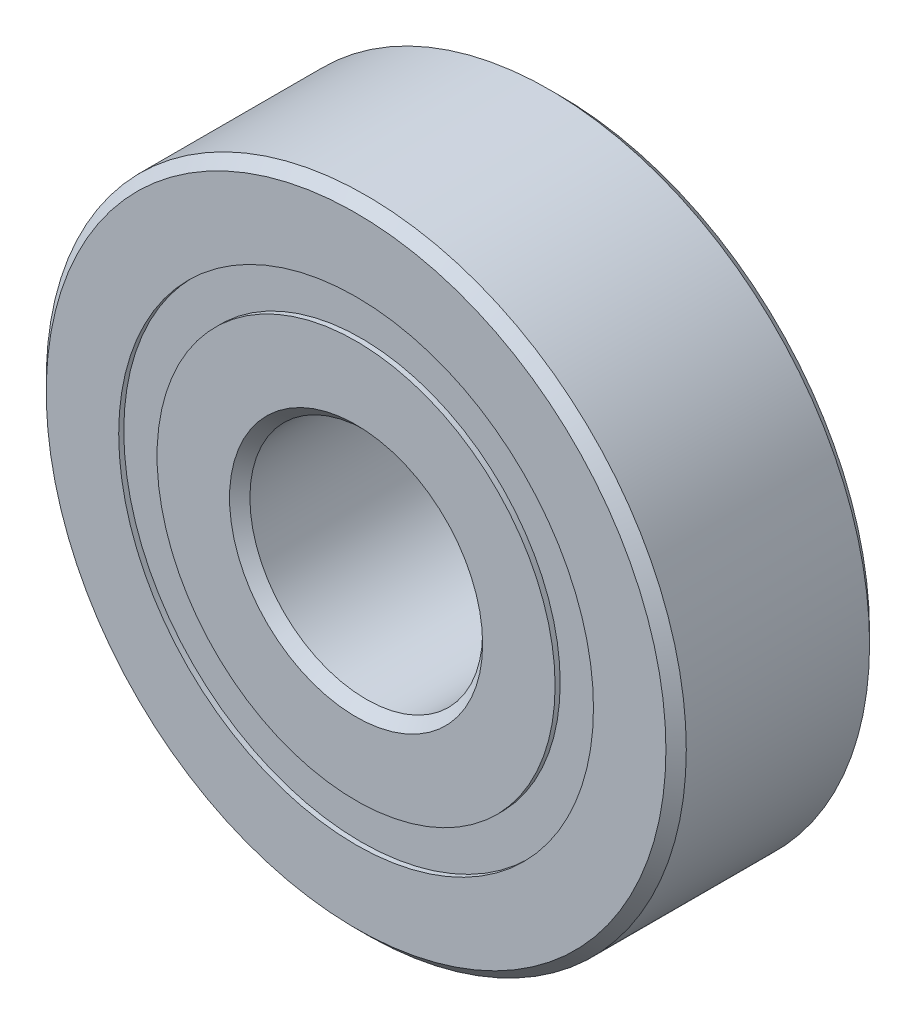
ISO-10303-21;
HEADER;
FILE_DESCRIPTION(('STEP AP214'),'2;1');
FILE_NAME('part.step','',(''),(''),'','','');
FILE_SCHEMA(('AUTOMOTIVE_DESIGN { 1 0 10303 214 1 1 1 1 }'));
ENDSEC;
DATA;
#1=APPLICATION_CONTEXT('core data for automotive mechanical design processes');
#2=APPLICATION_PROTOCOL_DEFINITION('international standard','automotive_design',2000,#1);
#3=PRODUCT_CONTEXT('',#1,'mechanical');
#4=PRODUCT('Part','Part','',(#3));
#5=PRODUCT_RELATED_PRODUCT_CATEGORY('part','',(#4));
#6=PRODUCT_DEFINITION_FORMATION('','',#4);
#7=PRODUCT_DEFINITION_CONTEXT('part definition',#1,'design');
#8=PRODUCT_DEFINITION('design','',#6,#7);
#9=PRODUCT_DEFINITION_SHAPE('','',#8);
#10=(LENGTH_UNIT() NAMED_UNIT(*) SI_UNIT(.MILLI.,.METRE.));
#11=(NAMED_UNIT(*) PLANE_ANGLE_UNIT() SI_UNIT($,.RADIAN.));
#12=(NAMED_UNIT(*) SI_UNIT($,.STERADIAN.) SOLID_ANGLE_UNIT());
#13=UNCERTAINTY_MEASURE_WITH_UNIT(LENGTH_MEASURE(1.E-05),#10,'distance_accuracy_value','');
#14=(GEOMETRIC_REPRESENTATION_CONTEXT(3) GLOBAL_UNCERTAINTY_ASSIGNED_CONTEXT((#13)) GLOBAL_UNIT_ASSIGNED_CONTEXT((#10,
#11,#12)) REPRESENTATION_CONTEXT('',''));
#15=CARTESIAN_POINT('',(0.,0.,0.));
#16=DIRECTION('',(0.,0.,1.));
#17=DIRECTION('',(1.,0.,0.));
#18=AXIS2_PLACEMENT_3D('',#15,#16,#17);
#19=CARTESIAN_POINT('',(0.,8.15934065934066,-3.325));
#20=DIRECTION('',(0.,0.,1.));
#21=DIRECTION('',(1.,0.,0.));
#22=AXIS2_PLACEMENT_3D('',#19,#20,#21);
#23=PLANE('',#22);
#24=CARTESIAN_POINT('',(0.,0.,-3.325));
#25=DIRECTION('',(0.,0.,1.));
#26=DIRECTION('',(1.,0.,0.));
#27=AXIS2_PLACEMENT_3D('',#24,#25,#26);
#28=CIRCLE('',#27,8.15934065934066);
#29=CARTESIAN_POINT('',(8.15934065934066,0.,-3.325));
#30=VERTEX_POINT('',#29);
#31=EDGE_CURVE('E64',#30,#30,#28,.T.);
#32=ORIENTED_EDGE('',*,*,#31,.F.);
#33=EDGE_LOOP('',(#32));
#34=FACE_BOUND('',#33,.T.);
#35=CARTESIAN_POINT('',(0.,0.,-3.325));
#36=DIRECTION('',(0.,0.,1.));
#37=DIRECTION('',(1.,0.,0.));
#38=AXIS2_PLACEMENT_3D('',#35,#36,#37);
#39=CIRCLE('',#38,6.84065934065934);
#40=CARTESIAN_POINT('',(6.84065934065934,0.,-3.325));
#41=VERTEX_POINT('',#40);
#42=EDGE_CURVE('E11',#41,#41,#39,.T.);
#43=ORIENTED_EDGE('',*,*,#42,.T.);
#44=EDGE_LOOP('',(#43));
#45=FACE_BOUND('',#44,.T.);
#46=ADVANCED_FACE('F50',(#34,#45),#23,.F.);
#47=CARTESIAN_POINT('',(0.,0.,3.5));
#48=DIRECTION('',(0.,0.,1.));
#49=DIRECTION('',(1.,0.,0.));
#50=AXIS2_PLACEMENT_3D('',#47,#48,#49);
#51=CYLINDRICAL_SURFACE('',#50,6.84065934065934);
#52=ORIENTED_EDGE('',*,*,#42,.F.);
#53=EDGE_LOOP('',(#52));
#54=FACE_BOUND('',#53,.T.);
#55=CARTESIAN_POINT('',(0.,0.,-1.68952158656808));
#56=DIRECTION('',(0.,0.,1.));
#57=DIRECTION('',(1.,0.,0.));
#58=AXIS2_PLACEMENT_3D('',#55,#56,#57);
#59=CIRCLE('',#58,6.84065934065934);
#60=CARTESIAN_POINT('',(6.84065934065934,0.,-1.68952158656808));
#61=VERTEX_POINT('',#60);
#62=EDGE_CURVE('E56',#61,#61,#59,.T.);
#63=ORIENTED_EDGE('',*,*,#62,.T.);
#64=EDGE_LOOP('',(#63));
#65=FACE_BOUND('',#64,.T.);
#66=ADVANCED_FACE('F73',(#54,#65),#51,.F.);
#67=CARTESIAN_POINT('',(0.,8.15934065934066,-1.68952158656808));
#68=DIRECTION('',(0.,0.,-1.));
#69=DIRECTION('',(-1.,0.,0.));
#70=AXIS2_PLACEMENT_3D('',#67,#68,#69);
#71=PLANE('',#70);
#72=ORIENTED_EDGE('',*,*,#62,.F.);
#73=EDGE_LOOP('',(#72));
#74=FACE_BOUND('',#73,.T.);
#75=CARTESIAN_POINT('',(0.,0.,-1.68952158656808));
#76=DIRECTION('',(0.,0.,1.));
#77=DIRECTION('',(1.,0.,0.));
#78=AXIS2_PLACEMENT_3D('',#75,#76,#77);
#79=CIRCLE('',#78,8.15934065934066);
#80=CARTESIAN_POINT('',(8.15934065934066,0.,-1.68952158656808));
#81=VERTEX_POINT('',#80);
#82=EDGE_CURVE('E60',#81,#81,#79,.T.);
#83=ORIENTED_EDGE('',*,*,#82,.T.);
#84=EDGE_LOOP('',(#83));
#85=FACE_BOUND('',#84,.T.);
#86=ADVANCED_FACE('F77',(#74,#85),#71,.F.);
#87=CARTESIAN_POINT('',(0.,0.,3.5));
#88=DIRECTION('',(0.,0.,1.));
#89=DIRECTION('',(1.,0.,0.));
#90=AXIS2_PLACEMENT_3D('',#87,#88,#89);
#91=CYLINDRICAL_SURFACE('',#90,8.15934065934066);
#92=ORIENTED_EDGE('',*,*,#82,.F.);
#93=EDGE_LOOP('',(#92));
#94=FACE_BOUND('',#93,.T.);
#95=ORIENTED_EDGE('',*,*,#31,.T.);
#96=EDGE_LOOP('',(#95));
#97=FACE_BOUND('',#96,.T.);
#98=ADVANCED_FACE('F70',(#94,#97),#91,.T.);
#99=CLOSED_SHELL('',(#46,#66,#86,#98));
#100=MANIFOLD_SOLID_BREP('B2',#99);
#101=CARTESIAN_POINT('',(0.,8.15934065934066,3.325));
#102=DIRECTION('',(0.,0.,-1.));
#103=DIRECTION('',(-1.,0.,0.));
#104=AXIS2_PLACEMENT_3D('',#101,#102,#103);
#105=PLANE('',#104);
#106=CARTESIAN_POINT('',(0.,0.,3.325));
#107=DIRECTION('',(0.,0.,1.));
#108=DIRECTION('',(1.,0.,0.));
#109=AXIS2_PLACEMENT_3D('',#106,#107,#108);
#110=CIRCLE('',#109,6.84065934065934);
#111=CARTESIAN_POINT('',(6.84065934065934,0.,3.325));
#112=VERTEX_POINT('',#111);
#113=EDGE_CURVE('E49',#112,#112,#110,.T.);
#114=ORIENTED_EDGE('',*,*,#113,.F.);
#115=EDGE_LOOP('',(#114));
#116=FACE_BOUND('',#115,.T.);
#117=CARTESIAN_POINT('',(0.,0.,3.325));
#118=DIRECTION('',(0.,0.,1.));
#119=DIRECTION('',(1.,0.,0.));
#120=AXIS2_PLACEMENT_3D('',#117,#118,#119);
#121=CIRCLE('',#120,8.15934065934066);
#122=CARTESIAN_POINT('',(8.15934065934066,0.,3.325));
#123=VERTEX_POINT('',#122);
#124=EDGE_CURVE('E136',#123,#123,#121,.T.);
#125=ORIENTED_EDGE('',*,*,#124,.T.);
#126=EDGE_LOOP('',(#125));
#127=FACE_BOUND('',#126,.T.);
#128=ADVANCED_FACE('F118',(#116,#127),#105,.F.);
#129=CARTESIAN_POINT('',(0.,0.,3.5));
#130=DIRECTION('',(0.,0.,1.));
#131=DIRECTION('',(1.,0.,0.));
#132=AXIS2_PLACEMENT_3D('',#129,#130,#131);
#133=CYLINDRICAL_SURFACE('',#132,6.84065934065934);
#134=CARTESIAN_POINT('',(0.,0.,1.68952158656808));
#135=DIRECTION('',(0.,0.,1.));
#136=DIRECTION('',(1.,0.,0.));
#137=AXIS2_PLACEMENT_3D('',#134,#135,#136);
#138=CIRCLE('',#137,6.84065934065934);
#139=CARTESIAN_POINT('',(6.84065934065934,0.,1.68952158656808));
#140=VERTEX_POINT('',#139);
#141=EDGE_CURVE('E125',#140,#140,#138,.T.);
#142=ORIENTED_EDGE('',*,*,#141,.F.);
#143=EDGE_LOOP('',(#142));
#144=FACE_BOUND('',#143,.T.);
#145=ORIENTED_EDGE('',*,*,#113,.T.);
#146=EDGE_LOOP('',(#145));
#147=FACE_BOUND('',#146,.T.);
#148=ADVANCED_FACE('F151',(#144,#147),#133,.F.);
#149=CARTESIAN_POINT('',(0.,8.15934065934066,1.68952158656808));
#150=DIRECTION('',(0.,0.,1.));
#151=DIRECTION('',(1.,0.,0.));
#152=AXIS2_PLACEMENT_3D('',#149,#150,#151);
#153=PLANE('',#152);
#154=CARTESIAN_POINT('',(0.,0.,1.68952158656808));
#155=DIRECTION('',(0.,0.,1.));
#156=DIRECTION('',(1.,0.,0.));
#157=AXIS2_PLACEMENT_3D('',#154,#155,#156);
#158=CIRCLE('',#157,8.15934065934066);
#159=CARTESIAN_POINT('',(8.15934065934066,0.,1.68952158656808));
#160=VERTEX_POINT('',#159);
#161=EDGE_CURVE('E131',#160,#160,#158,.T.);
#162=ORIENTED_EDGE('',*,*,#161,.F.);
#163=EDGE_LOOP('',(#162));
#164=FACE_BOUND('',#163,.T.);
#165=ORIENTED_EDGE('',*,*,#141,.T.);
#166=EDGE_LOOP('',(#165));
#167=FACE_BOUND('',#166,.T.);
#168=ADVANCED_FACE('F146',(#164,#167),#153,.F.);
#169=CARTESIAN_POINT('',(0.,0.,3.5));
#170=DIRECTION('',(0.,0.,1.));
#171=DIRECTION('',(1.,0.,0.));
#172=AXIS2_PLACEMENT_3D('',#169,#170,#171);
#173=CYLINDRICAL_SURFACE('',#172,8.15934065934066);
#174=ORIENTED_EDGE('',*,*,#124,.F.);
#175=EDGE_LOOP('',(#174));
#176=FACE_BOUND('',#175,.T.);
#177=ORIENTED_EDGE('',*,*,#161,.T.);
#178=EDGE_LOOP('',(#177));
#179=FACE_BOUND('',#178,.T.);
#180=ADVANCED_FACE('F143',(#176,#179),#173,.T.);
#181=CLOSED_SHELL('',(#128,#148,#168,#180));
#182=MANIFOLD_SOLID_BREP('B6',#181);
#183=CARTESIAN_POINT('',(-3.74999999999992,6.49519052838334,0.));
#184=DIRECTION('',(0.,0.,1.));
#185=DIRECTION('',(-0.499999999999989,0.866025403784445,0.));
#186=AXIS2_PLACEMENT_3D('',#183,#184,#185);
#187=SPHERICAL_SURFACE('',#186,1.68952158656808);
#188=CARTESIAN_POINT('',(-3.74999999999992,6.49519052838334,1.68952158656808));
#189=VERTEX_POINT('',#188);
#190=VERTEX_LOOP('',#189);
#191=FACE_BOUND('',#190,.T.);
#192=ADVANCED_FACE('F190',(#191),#187,.T.);
#193=CLOSED_SHELL('',(#192));
#194=MANIFOLD_SOLID_BREP('B44',#193);
#195=CARTESIAN_POINT('',(-6.49519052838325,3.75000000000008,0.));
#196=DIRECTION('',(0.,0.,1.));
#197=DIRECTION('',(-0.866025403784433,0.50000000000001,0.));
#198=AXIS2_PLACEMENT_3D('',#195,#196,#197);
#199=SPHERICAL_SURFACE('',#198,1.68952158656808);
#200=CARTESIAN_POINT('',(-6.49519052838325,3.75000000000008,1.68952158656808));
#201=VERTEX_POINT('',#200);
#202=VERTEX_LOOP('',#201);
#203=FACE_BOUND('',#202,.T.);
#204=ADVANCED_FACE('F211',(#203),#199,.T.);
#205=CLOSED_SHELL('',(#204));
#206=MANIFOLD_SOLID_BREP('B114',#205);
#207=CARTESIAN_POINT('',(-7.5,0.,0.));
#208=DIRECTION('',(0.,0.,1.));
#209=DIRECTION('',(-1.,0.,0.));
#210=AXIS2_PLACEMENT_3D('',#207,#208,#209);
#211=SPHERICAL_SURFACE('',#210,1.68952158656808);
#212=CARTESIAN_POINT('',(-7.5,0.,1.68952158656808));
#213=VERTEX_POINT('',#212);
#214=VERTEX_LOOP('',#213);
#215=FACE_BOUND('',#214,.T.);
#216=ADVANCED_FACE('F232',(#215),#211,.T.);
#217=CLOSED_SHELL('',(#216));
#218=MANIFOLD_SOLID_BREP('B186',#217);
#219=CARTESIAN_POINT('',(-6.49519052838332,-3.74999999999994,0.));
#220=DIRECTION('',(0.,0.,1.));
#221=DIRECTION('',(-0.866025403784443,-0.499999999999992,0.));
#222=AXIS2_PLACEMENT_3D('',#219,#220,#221);
#223=SPHERICAL_SURFACE('',#222,1.68952158656808);
#224=CARTESIAN_POINT('',(-6.49519052838332,-3.74999999999994,1.68952158656808));
#225=VERTEX_POINT('',#224);
#226=VERTEX_LOOP('',#225);
#227=FACE_BOUND('',#226,.T.);
#228=ADVANCED_FACE('F253',(#227),#223,.T.);
#229=CLOSED_SHELL('',(#228));
#230=MANIFOLD_SOLID_BREP('B207',#229);
#231=CARTESIAN_POINT('',(-3.75000000000005,-6.49519052838326,0.));
#232=DIRECTION('',(0.,0.,1.));
#233=DIRECTION('',(-0.500000000000007,-0.866025403784435,0.));
#234=AXIS2_PLACEMENT_3D('',#231,#232,#233);
#235=SPHERICAL_SURFACE('',#234,1.68952158656808);
#236=CARTESIAN_POINT('',(-3.75000000000005,-6.49519052838326,1.68952158656808));
#237=VERTEX_POINT('',#236);
#238=VERTEX_LOOP('',#237);
#239=FACE_BOUND('',#238,.T.);
#240=ADVANCED_FACE('F274',(#239),#235,.T.);
#241=CLOSED_SHELL('',(#240));
#242=MANIFOLD_SOLID_BREP('B228',#241);
#243=CARTESIAN_POINT('',(0.,-7.5,0.));
#244=DIRECTION('',(0.,0.,1.));
#245=DIRECTION('',(0.,-1.,0.));
#246=AXIS2_PLACEMENT_3D('',#243,#244,#245);
#247=SPHERICAL_SURFACE('',#246,1.68952158656808);
#248=CARTESIAN_POINT('',(0.,-7.5,1.68952158656808));
#249=VERTEX_POINT('',#248);
#250=VERTEX_LOOP('',#249);
#251=FACE_BOUND('',#250,.T.);
#252=ADVANCED_FACE('F295',(#251),#247,.T.);
#253=CLOSED_SHELL('',(#252));
#254=MANIFOLD_SOLID_BREP('B249',#253);
#255=CARTESIAN_POINT('',(3.74999999999996,-6.49519052838331,0.));
#256=DIRECTION('',(0.,0.,1.));
#257=DIRECTION('',(0.499999999999995,-0.866025403784442,0.));
#258=AXIS2_PLACEMENT_3D('',#255,#256,#257);
#259=SPHERICAL_SURFACE('',#258,1.68952158656808);
#260=CARTESIAN_POINT('',(3.74999999999996,-6.49519052838331,1.68952158656808));
#261=VERTEX_POINT('',#260);
#262=VERTEX_LOOP('',#261);
#263=FACE_BOUND('',#262,.T.);
#264=ADVANCED_FACE('F316',(#263),#259,.T.);
#265=CLOSED_SHELL('',(#264));
#266=MANIFOLD_SOLID_BREP('B270',#265);
#267=CARTESIAN_POINT('',(6.49519052838327,-3.75000000000003,0.));
#268=DIRECTION('',(0.,0.,1.));
#269=DIRECTION('',(0.866025403784436,-0.500000000000004,0.));
#270=AXIS2_PLACEMENT_3D('',#267,#268,#269);
#271=SPHERICAL_SURFACE('',#270,1.68952158656808);
#272=CARTESIAN_POINT('',(6.49519052838327,-3.75000000000003,1.68952158656808));
#273=VERTEX_POINT('',#272);
#274=VERTEX_LOOP('',#273);
#275=FACE_BOUND('',#274,.T.);
#276=ADVANCED_FACE('F337',(#275),#271,.T.);
#277=CLOSED_SHELL('',(#276));
#278=MANIFOLD_SOLID_BREP('B291',#277);
#279=CARTESIAN_POINT('',(7.5,0.,0.));
#280=DIRECTION('',(0.,0.,1.));
#281=DIRECTION('',(1.,0.,0.));
#282=AXIS2_PLACEMENT_3D('',#279,#280,#281);
#283=SPHERICAL_SURFACE('',#282,1.68952158656808);
#284=CARTESIAN_POINT('',(7.5,0.,1.68952158656808));
#285=VERTEX_POINT('',#284);
#286=VERTEX_LOOP('',#285);
#287=FACE_BOUND('',#286,.T.);
#288=ADVANCED_FACE('F358',(#287),#283,.T.);
#289=CLOSED_SHELL('',(#288));
#290=MANIFOLD_SOLID_BREP('B312',#289);
#291=CARTESIAN_POINT('',(6.4951905283833,3.74999999999998,0.));
#292=DIRECTION('',(0.,0.,1.));
#293=DIRECTION('',(0.86602540378444,0.499999999999998,0.));
#294=AXIS2_PLACEMENT_3D('',#291,#292,#293);
#295=SPHERICAL_SURFACE('',#294,1.68952158656808);
#296=CARTESIAN_POINT('',(6.4951905283833,3.74999999999998,1.68952158656808));
#297=VERTEX_POINT('',#296);
#298=VERTEX_LOOP('',#297);
#299=FACE_BOUND('',#298,.T.);
#300=ADVANCED_FACE('F379',(#299),#295,.T.);
#301=CLOSED_SHELL('',(#300));
#302=MANIFOLD_SOLID_BREP('B333',#301);
#303=CARTESIAN_POINT('',(3.75000000000001,6.49519052838328,0.));
#304=DIRECTION('',(0.,0.,1.));
#305=DIRECTION('',(0.500000000000001,0.866025403784438,0.));
#306=AXIS2_PLACEMENT_3D('',#303,#304,#305);
#307=SPHERICAL_SURFACE('',#306,1.68952158656808);
#308=CARTESIAN_POINT('',(3.75000000000001,6.49519052838328,1.68952158656808));
#309=VERTEX_POINT('',#308);
#310=VERTEX_LOOP('',#309);
#311=FACE_BOUND('',#310,.T.);
#312=ADVANCED_FACE('F400',(#311),#307,.T.);
#313=CLOSED_SHELL('',(#312));
#314=MANIFOLD_SOLID_BREP('B354',#313);
#315=CARTESIAN_POINT('',(0.,7.5,0.));
#316=DIRECTION('',(0.,0.,1.));
#317=DIRECTION('',(0.,1.,0.));
#318=AXIS2_PLACEMENT_3D('',#315,#316,#317);
#319=SPHERICAL_SURFACE('',#318,1.68952158656808);
#320=CARTESIAN_POINT('',(0.,7.5,1.68952158656808));
#321=VERTEX_POINT('',#320);
#322=VERTEX_LOOP('',#321);
#323=FACE_BOUND('',#322,.T.);
#324=ADVANCED_FACE('F423',(#323),#319,.T.);
#325=CLOSED_SHELL('',(#324));
#326=MANIFOLD_SOLID_BREP('B375',#325);
#327=CARTESIAN_POINT('',(0.,6.84065934065934,3.5));
#328=DIRECTION('',(0.,0.,-1.));
#329=DIRECTION('',(-1.,0.,0.));
#330=AXIS2_PLACEMENT_3D('',#327,#328,#329);
#331=PLANE('',#330);
#332=CARTESIAN_POINT('',(0.,0.,3.5));
#333=DIRECTION('',(0.,0.,1.));
#334=DIRECTION('',(1.,0.,0.));
#335=AXIS2_PLACEMENT_3D('',#332,#333,#334);
#336=CIRCLE('',#335,4.35);
#337=CARTESIAN_POINT('',(4.35,0.,3.5));
#338=VERTEX_POINT('',#337);
#339=EDGE_CURVE('E473',#338,#338,#336,.T.);
#340=ORIENTED_EDGE('',*,*,#339,.F.);
#341=EDGE_LOOP('',(#340));
#342=FACE_BOUND('',#341,.T.);
#343=CARTESIAN_POINT('',(0.,0.,3.5));
#344=DIRECTION('',(0.,0.,1.));
#345=DIRECTION('',(1.,0.,0.));
#346=AXIS2_PLACEMENT_3D('',#343,#344,#345);
#347=CIRCLE('',#346,6.84065934065934);
#348=CARTESIAN_POINT('',(6.84065934065934,0.,3.5));
#349=VERTEX_POINT('',#348);
#350=EDGE_CURVE('E422',#349,#349,#347,.T.);
#351=ORIENTED_EDGE('',*,*,#350,.T.);
#352=EDGE_LOOP('',(#351));
#353=FACE_BOUND('',#352,.T.);
#354=ADVANCED_FACE('F443',(#342,#353),#331,.F.);
#355=CARTESIAN_POINT('',(0.,0.,3.5));
#356=DIRECTION('',(0.,0.,1.));
#357=DIRECTION('',(1.,0.,0.));
#358=AXIS2_PLACEMENT_3D('',#355,#356,#357);
#359=CYLINDRICAL_SURFACE('',#358,6.84065934065934);
#360=ORIENTED_EDGE('',*,*,#350,.F.);
#361=EDGE_LOOP('',(#360));
#362=FACE_BOUND('',#361,.T.);
#363=CARTESIAN_POINT('',(0.,0.,1.55555555555556));
#364=DIRECTION('',(0.,0.,1.));
#365=DIRECTION('',(1.,0.,0.));
#366=AXIS2_PLACEMENT_3D('',#363,#364,#365);
#367=CIRCLE('',#366,6.84065934065934);
#368=CARTESIAN_POINT('',(6.84065934065934,0.,1.55555555555556));
#369=VERTEX_POINT('',#368);
#370=EDGE_CURVE('E450',#369,#369,#367,.T.);
#371=ORIENTED_EDGE('',*,*,#370,.T.);
#372=EDGE_LOOP('',(#371));
#373=FACE_BOUND('',#372,.T.);
#374=ADVANCED_FACE('F480',(#362,#373),#359,.T.);
#375=CARTESIAN_POINT('',(0.,0.,0.));
#376=DIRECTION('',(0.,0.,1.));
#377=DIRECTION('',(1.,0.,0.));
#378=AXIS2_PLACEMENT_3D('',#375,#376,#377);
#379=TOROIDAL_SURFACE('',#378,7.49999999999999,1.68952158656808);
#380=ORIENTED_EDGE('',*,*,#370,.F.);
#381=EDGE_LOOP('',(#380));
#382=FACE_BOUND('',#381,.T.);
#383=CARTESIAN_POINT('',(0.,0.,-1.55555555555556));
#384=DIRECTION('',(0.,0.,1.));
#385=DIRECTION('',(1.,0.,0.));
#386=AXIS2_PLACEMENT_3D('',#383,#384,#385);
#387=CIRCLE('',#386,6.84065934065934);
#388=CARTESIAN_POINT('',(6.84065934065934,0.,-1.55555555555556));
#389=VERTEX_POINT('',#388);
#390=EDGE_CURVE('E455',#389,#389,#387,.T.);
#391=ORIENTED_EDGE('',*,*,#390,.T.);
#392=EDGE_LOOP('',(#391));
#393=FACE_BOUND('',#392,.T.);
#394=ADVANCED_FACE('F484',(#382,#393),#379,.F.);
#395=CARTESIAN_POINT('',(0.,0.,3.5));
#396=DIRECTION('',(0.,0.,1.));
#397=DIRECTION('',(1.,0.,0.));
#398=AXIS2_PLACEMENT_3D('',#395,#396,#397);
#399=CYLINDRICAL_SURFACE('',#398,6.84065934065934);
#400=ORIENTED_EDGE('',*,*,#390,.F.);
#401=EDGE_LOOP('',(#400));
#402=FACE_BOUND('',#401,.T.);
#403=CARTESIAN_POINT('',(0.,0.,-3.5));
#404=DIRECTION('',(0.,0.,1.));
#405=DIRECTION('',(1.,0.,0.));
#406=AXIS2_PLACEMENT_3D('',#403,#404,#405);
#407=CIRCLE('',#406,6.84065934065934);
#408=CARTESIAN_POINT('',(6.84065934065934,0.,-3.5));
#409=VERTEX_POINT('',#408);
#410=EDGE_CURVE('E459',#409,#409,#407,.T.);
#411=ORIENTED_EDGE('',*,*,#410,.T.);
#412=EDGE_LOOP('',(#411));
#413=FACE_BOUND('',#412,.T.);
#414=ADVANCED_FACE('F489',(#402,#413),#399,.T.);
#415=CARTESIAN_POINT('',(0.,4.35,-3.5));
#416=DIRECTION('',(0.,0.,1.));
#417=DIRECTION('',(1.,0.,0.));
#418=AXIS2_PLACEMENT_3D('',#415,#416,#417);
#419=PLANE('',#418);
#420=ORIENTED_EDGE('',*,*,#410,.F.);
#421=EDGE_LOOP('',(#420));
#422=FACE_BOUND('',#421,.T.);
#423=CARTESIAN_POINT('',(0.,0.,-3.5));
#424=DIRECTION('',(0.,0.,1.));
#425=DIRECTION('',(1.,0.,0.));
#426=AXIS2_PLACEMENT_3D('',#423,#424,#425);
#427=CIRCLE('',#426,4.35);
#428=CARTESIAN_POINT('',(4.35,0.,-3.5));
#429=VERTEX_POINT('',#428);
#430=EDGE_CURVE('E464',#429,#429,#427,.T.);
#431=ORIENTED_EDGE('',*,*,#430,.T.);
#432=EDGE_LOOP('',(#431));
#433=FACE_BOUND('',#432,.T.);
#434=ADVANCED_FACE('F495',(#422,#433),#419,.F.);
#435=CARTESIAN_POINT('',(0.,0.,-3.15));
#436=DIRECTION('',(0.,0.,-1.));
#437=DIRECTION('',(-1.,0.,0.));
#438=AXIS2_PLACEMENT_3D('',#435,#436,#437);
#439=CONICAL_SURFACE('',#438,4.,0.785398163397451);
#440=ORIENTED_EDGE('',*,*,#430,.F.);
#441=EDGE_LOOP('',(#440));
#442=FACE_BOUND('',#441,.T.);
#443=CARTESIAN_POINT('',(0.,0.,-3.15));
#444=DIRECTION('',(0.,0.,1.));
#445=DIRECTION('',(1.,0.,0.));
#446=AXIS2_PLACEMENT_3D('',#443,#444,#445);
#447=CIRCLE('',#446,4.);
#448=CARTESIAN_POINT('',(4.,0.,-3.15));
#449=VERTEX_POINT('',#448);
#450=EDGE_CURVE('E467',#449,#449,#447,.T.);
#451=ORIENTED_EDGE('',*,*,#450,.T.);
#452=EDGE_LOOP('',(#451));
#453=FACE_BOUND('',#452,.T.);
#454=ADVANCED_FACE('F499',(#442,#453),#439,.F.);
#455=CARTESIAN_POINT('',(0.,0.,3.5));
#456=DIRECTION('',(0.,0.,1.));
#457=DIRECTION('',(1.,0.,0.));
#458=AXIS2_PLACEMENT_3D('',#455,#456,#457);
#459=CYLINDRICAL_SURFACE('',#458,4.);
#460=ORIENTED_EDGE('',*,*,#450,.F.);
#461=EDGE_LOOP('',(#460));
#462=FACE_BOUND('',#461,.T.);
#463=CARTESIAN_POINT('',(0.,0.,3.15));
#464=DIRECTION('',(0.,0.,1.));
#465=DIRECTION('',(1.,0.,0.));
#466=AXIS2_PLACEMENT_3D('',#463,#464,#465);
#467=CIRCLE('',#466,4.);
#468=CARTESIAN_POINT('',(4.,0.,3.15));
#469=VERTEX_POINT('',#468);
#470=EDGE_CURVE('E470',#469,#469,#467,.T.);
#471=ORIENTED_EDGE('',*,*,#470,.T.);
#472=EDGE_LOOP('',(#471));
#473=FACE_BOUND('',#472,.T.);
#474=ADVANCED_FACE('F503',(#462,#473),#459,.F.);
#475=CARTESIAN_POINT('',(0.,0.,3.5));
#476=DIRECTION('',(0.,0.,1.));
#477=DIRECTION('',(1.,0.,0.));
#478=AXIS2_PLACEMENT_3D('',#475,#476,#477);
#479=CONICAL_SURFACE('',#478,4.35,0.785398163397447);
#480=ORIENTED_EDGE('',*,*,#470,.F.);
#481=EDGE_LOOP('',(#480));
#482=FACE_BOUND('',#481,.T.);
#483=ORIENTED_EDGE('',*,*,#339,.T.);
#484=EDGE_LOOP('',(#483));
#485=FACE_BOUND('',#484,.T.);
#486=ADVANCED_FACE('F477',(#482,#485),#479,.F.);
#487=CLOSED_SHELL('',(#354,#374,#394,#414,#434,#454,#474,#486));
#488=MANIFOLD_SOLID_BREP('B396',#487);
#489=CARTESIAN_POINT('',(0.,0.,3.15));
#490=DIRECTION('',(0.,0.,-1.));
#491=DIRECTION('',(-1.,0.,0.));
#492=AXIS2_PLACEMENT_3D('',#489,#490,#491);
#493=CONICAL_SURFACE('',#492,11.,0.78539816339745);
#494=CARTESIAN_POINT('',(0.,0.,3.5));
#495=DIRECTION('',(0.,0.,1.));
#496=DIRECTION('',(1.,0.,0.));
#497=AXIS2_PLACEMENT_3D('',#494,#495,#496);
#498=CIRCLE('',#497,10.65);
#499=CARTESIAN_POINT('',(10.65,0.,3.5));
#500=VERTEX_POINT('',#499);
#501=EDGE_CURVE('E603',#500,#500,#498,.T.);
#502=ORIENTED_EDGE('',*,*,#501,.F.);
#503=EDGE_LOOP('',(#502));
#504=FACE_BOUND('',#503,.T.);
#505=CARTESIAN_POINT('',(0.,0.,3.15));
#506=DIRECTION('',(0.,0.,1.));
#507=DIRECTION('',(1.,0.,0.));
#508=AXIS2_PLACEMENT_3D('',#505,#506,#507);
#509=CIRCLE('',#508,11.);
#510=CARTESIAN_POINT('',(11.,0.,3.15));
#511=VERTEX_POINT('',#510);
#512=EDGE_CURVE('E442',#511,#511,#509,.T.);
#513=ORIENTED_EDGE('',*,*,#512,.T.);
#514=EDGE_LOOP('',(#513));
#515=FACE_BOUND('',#514,.T.);
#516=ADVANCED_FACE('F567',(#504,#515),#493,.T.);
#517=CARTESIAN_POINT('',(0.,0.,3.5));
#518=DIRECTION('',(0.,0.,1.));
#519=DIRECTION('',(1.,0.,0.));
#520=AXIS2_PLACEMENT_3D('',#517,#518,#519);
#521=CYLINDRICAL_SURFACE('',#520,11.);
#522=ORIENTED_EDGE('',*,*,#512,.F.);
#523=EDGE_LOOP('',(#522));
#524=FACE_BOUND('',#523,.T.);
#525=CARTESIAN_POINT('',(0.,0.,-3.15));
#526=DIRECTION('',(0.,0.,1.));
#527=DIRECTION('',(1.,0.,0.));
#528=AXIS2_PLACEMENT_3D('',#525,#526,#527);
#529=CIRCLE('',#528,11.);
#530=CARTESIAN_POINT('',(11.,0.,-3.15));
#531=VERTEX_POINT('',#530);
#532=EDGE_CURVE('E574',#531,#531,#529,.T.);
#533=ORIENTED_EDGE('',*,*,#532,.T.);
#534=EDGE_LOOP('',(#533));
#535=FACE_BOUND('',#534,.T.);
#536=ADVANCED_FACE('F610',(#524,#535),#521,.T.);
#537=CARTESIAN_POINT('',(0.,0.,-3.5));
#538=DIRECTION('',(0.,0.,1.));
#539=DIRECTION('',(1.,0.,0.));
#540=AXIS2_PLACEMENT_3D('',#537,#538,#539);
#541=CONICAL_SURFACE('',#540,10.65,0.785398163397448);
#542=ORIENTED_EDGE('',*,*,#532,.F.);
#543=EDGE_LOOP('',(#542));
#544=FACE_BOUND('',#543,.T.);
#545=CARTESIAN_POINT('',(0.,0.,-3.5));
#546=DIRECTION('',(0.,0.,1.));
#547=DIRECTION('',(1.,0.,0.));
#548=AXIS2_PLACEMENT_3D('',#545,#546,#547);
#549=CIRCLE('',#548,10.65);
#550=CARTESIAN_POINT('',(10.65,0.,-3.5));
#551=VERTEX_POINT('',#550);
#552=EDGE_CURVE('E581',#551,#551,#549,.T.);
#553=ORIENTED_EDGE('',*,*,#552,.T.);
#554=EDGE_LOOP('',(#553));
#555=FACE_BOUND('',#554,.T.);
#556=ADVANCED_FACE('F614',(#544,#555),#541,.T.);
#557=CARTESIAN_POINT('',(0.,10.65,-3.5));
#558=DIRECTION('',(0.,0.,1.));
#559=DIRECTION('',(1.,0.,0.));
#560=AXIS2_PLACEMENT_3D('',#557,#558,#559);
#561=PLANE('',#560);
#562=ORIENTED_EDGE('',*,*,#552,.F.);
#563=EDGE_LOOP('',(#562));
#564=FACE_BOUND('',#563,.T.);
#565=CARTESIAN_POINT('',(0.,0.,-3.5));
#566=DIRECTION('',(0.,0.,1.));
#567=DIRECTION('',(1.,0.,0.));
#568=AXIS2_PLACEMENT_3D('',#565,#566,#567);
#569=CIRCLE('',#568,8.15934065934066);
#570=CARTESIAN_POINT('',(8.15934065934066,0.,-3.5));
#571=VERTEX_POINT('',#570);
#572=EDGE_CURVE('E587',#571,#571,#569,.T.);
#573=ORIENTED_EDGE('',*,*,#572,.T.);
#574=EDGE_LOOP('',(#573));
#575=FACE_BOUND('',#574,.T.);
#576=ADVANCED_FACE('F619',(#564,#575),#561,.F.);
#577=CARTESIAN_POINT('',(0.,0.,3.5));
#578=DIRECTION('',(0.,0.,1.));
#579=DIRECTION('',(1.,0.,0.));
#580=AXIS2_PLACEMENT_3D('',#577,#578,#579);
#581=CYLINDRICAL_SURFACE('',#580,8.15934065934066);
#582=ORIENTED_EDGE('',*,*,#572,.F.);
#583=EDGE_LOOP('',(#582));
#584=FACE_BOUND('',#583,.T.);
#585=CARTESIAN_POINT('',(0.,0.,-1.55555555555556));
#586=DIRECTION('',(0.,0.,1.));
#587=DIRECTION('',(1.,0.,0.));
#588=AXIS2_PLACEMENT_3D('',#585,#586,#587);
#589=CIRCLE('',#588,8.15934065934066);
#590=CARTESIAN_POINT('',(8.15934065934066,0.,-1.55555555555556));
#591=VERTEX_POINT('',#590);
#592=EDGE_CURVE('E593',#591,#591,#589,.T.);
#593=ORIENTED_EDGE('',*,*,#592,.T.);
#594=EDGE_LOOP('',(#593));
#595=FACE_BOUND('',#594,.T.);
#596=ADVANCED_FACE('F625',(#584,#595),#581,.F.);
#597=CARTESIAN_POINT('',(0.,0.,0.));
#598=DIRECTION('',(0.,0.,1.));
#599=DIRECTION('',(1.,0.,0.));
#600=AXIS2_PLACEMENT_3D('',#597,#598,#599);
#601=TOROIDAL_SURFACE('',#600,7.5,1.68952158656808);
#602=ORIENTED_EDGE('',*,*,#592,.F.);
#603=EDGE_LOOP('',(#602));
#604=FACE_BOUND('',#603,.T.);
#605=CARTESIAN_POINT('',(0.,0.,1.55555555555556));
#606=DIRECTION('',(0.,0.,1.));
#607=DIRECTION('',(1.,0.,0.));
#608=AXIS2_PLACEMENT_3D('',#605,#606,#607);
#609=CIRCLE('',#608,8.15934065934066);
#610=CARTESIAN_POINT('',(8.15934065934066,0.,1.55555555555556));
#611=VERTEX_POINT('',#610);
#612=EDGE_CURVE('E596',#611,#611,#609,.T.);
#613=ORIENTED_EDGE('',*,*,#612,.T.);
#614=EDGE_LOOP('',(#613));
#615=FACE_BOUND('',#614,.T.);
#616=ADVANCED_FACE('F629',(#604,#615),#601,.F.);
#617=CARTESIAN_POINT('',(0.,0.,3.5));
#618=DIRECTION('',(0.,0.,1.));
#619=DIRECTION('',(1.,0.,0.));
#620=AXIS2_PLACEMENT_3D('',#617,#618,#619);
#621=CYLINDRICAL_SURFACE('',#620,8.15934065934066);
#622=ORIENTED_EDGE('',*,*,#612,.F.);
#623=EDGE_LOOP('',(#622));
#624=FACE_BOUND('',#623,.T.);
#625=CARTESIAN_POINT('',(0.,0.,3.5));
#626=DIRECTION('',(0.,0.,1.));
#627=DIRECTION('',(1.,0.,0.));
#628=AXIS2_PLACEMENT_3D('',#625,#626,#627);
#629=CIRCLE('',#628,8.15934065934066);
#630=CARTESIAN_POINT('',(8.15934065934066,0.,3.5));
#631=VERTEX_POINT('',#630);
#632=EDGE_CURVE('E599',#631,#631,#629,.T.);
#633=ORIENTED_EDGE('',*,*,#632,.T.);
#634=EDGE_LOOP('',(#633));
#635=FACE_BOUND('',#634,.T.);
#636=ADVANCED_FACE('F633',(#624,#635),#621,.F.);
#637=CARTESIAN_POINT('',(0.,10.65,3.5));
#638=DIRECTION('',(0.,0.,-1.));
#639=DIRECTION('',(-1.,0.,0.));
#640=AXIS2_PLACEMENT_3D('',#637,#638,#639);
#641=PLANE('',#640);
#642=ORIENTED_EDGE('',*,*,#632,.F.);
#643=EDGE_LOOP('',(#642));
#644=FACE_BOUND('',#643,.T.);
#645=ORIENTED_EDGE('',*,*,#501,.T.);
#646=EDGE_LOOP('',(#645));
#647=FACE_BOUND('',#646,.T.);
#648=ADVANCED_FACE('F607',(#644,#647),#641,.F.);
#649=CLOSED_SHELL('',(#516,#536,#556,#576,#596,#616,#636,#648));
#650=MANIFOLD_SOLID_BREP('B417',#649);
#651=ADVANCED_BREP_SHAPE_REPRESENTATION('',(#18,#100,#182,#194,#206,#218,#230,#242,#254,#266,
#278,#290,#302,#314,#326,#488,#650),#14);
#652=SHAPE_DEFINITION_REPRESENTATION(#9,#651);
ENDSEC;
END-ISO-10303-21;
